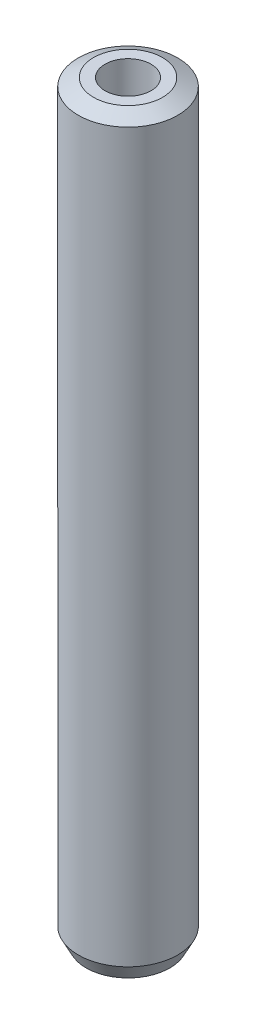
ISO-10303-21;
HEADER;
FILE_DESCRIPTION(('STEP AP214'),'2;1');
FILE_NAME('part.step','',(''),(''),'','','');
FILE_SCHEMA(('AUTOMOTIVE_DESIGN { 1 0 10303 214 1 1 1 1 }'));
ENDSEC;
DATA;
#1=APPLICATION_CONTEXT('core data for automotive mechanical design processes');
#2=APPLICATION_PROTOCOL_DEFINITION('international standard','automotive_design',2000,#1);
#3=PRODUCT_CONTEXT('',#1,'mechanical');
#4=PRODUCT('Part','Part','',(#3));
#5=PRODUCT_RELATED_PRODUCT_CATEGORY('part','',(#4));
#6=PRODUCT_DEFINITION_FORMATION('','',#4);
#7=PRODUCT_DEFINITION_CONTEXT('part definition',#1,'design');
#8=PRODUCT_DEFINITION('design','',#6,#7);
#9=PRODUCT_DEFINITION_SHAPE('','',#8);
#10=(LENGTH_UNIT() NAMED_UNIT(*) SI_UNIT(.MILLI.,.METRE.));
#11=(NAMED_UNIT(*) PLANE_ANGLE_UNIT() SI_UNIT($,.RADIAN.));
#12=(NAMED_UNIT(*) SI_UNIT($,.STERADIAN.) SOLID_ANGLE_UNIT());
#13=UNCERTAINTY_MEASURE_WITH_UNIT(LENGTH_MEASURE(1.E-05),#10,'distance_accuracy_value','');
#14=(GEOMETRIC_REPRESENTATION_CONTEXT(3) GLOBAL_UNCERTAINTY_ASSIGNED_CONTEXT((#13)) GLOBAL_UNIT_ASSIGNED_CONTEXT((#10,
#11,#12)) REPRESENTATION_CONTEXT('',''));
#15=CARTESIAN_POINT('',(0.,0.,0.));
#16=DIRECTION('',(0.,0.,1.));
#17=DIRECTION('',(1.,0.,0.));
#18=AXIS2_PLACEMENT_3D('',#15,#16,#17);
#19=CARTESIAN_POINT('',(0.,377.081839434753,0.));
#20=DIRECTION('',(0.,-1.,0.));
#21=DIRECTION('',(0.,0.,-1.));
#22=AXIS2_PLACEMENT_3D('',#19,#20,#21);
#23=CYLINDRICAL_SURFACE('',#22,25.);
#24=CARTESIAN_POINT('',(0.,373.112786849793,0.));
#25=DIRECTION('',(0.,1.,0.));
#26=DIRECTION('',(0.,0.,1.));
#27=AXIS2_PLACEMENT_3D('',#24,#25,#26);
#28=CIRCLE('',#27,25.);
#29=CARTESIAN_POINT('',(0.,373.112786849793,-25.));
#30=VERTEX_POINT('',#29);
#31=EDGE_CURVE('E50',#30,#30,#28,.F.);
#32=CARTESIAN_POINT('',(0.,7.66266430747042,0.));
#33=DIRECTION('',(0.,1.,0.));
#34=DIRECTION('',(0.,0.,1.));
#35=AXIS2_PLACEMENT_3D('',#32,#33,#34);
#36=CIRCLE('',#35,25.);
#37=CARTESIAN_POINT('',(0.,7.66266430747037,-25.));
#38=VERTEX_POINT('',#37);
#39=EDGE_CURVE('E51',#38,#38,#36,.T.);
#40=CARTESIAN_POINT('',(0.,373.112786849793,-25.));
#41=CARTESIAN_POINT('',(0.,369.306014739977,-25.));
#42=CARTESIAN_POINT('',(0.,365.499242630161,-25.));
#43=CARTESIAN_POINT('',(0.,357.88569841053,-25.));
#44=CARTESIAN_POINT('',(0.,354.078926300714,-25.));
#45=CARTESIAN_POINT('',(0.,346.465382081082,-25.));
#46=CARTESIAN_POINT('',(0.,342.658609971266,-25.));
#47=CARTESIAN_POINT('',(0.,335.045065751634,-25.));
#48=CARTESIAN_POINT('',(0.,331.238293641819,-25.));
#49=CARTESIAN_POINT('',(0.,323.624749422187,-25.));
#50=CARTESIAN_POINT('',(0.,319.817977312371,-25.));
#51=CARTESIAN_POINT('',(0.,312.204433092739,-25.));
#52=CARTESIAN_POINT('',(0.,308.397660982923,-25.));
#53=CARTESIAN_POINT('',(0.,300.784116763292,-25.));
#54=CARTESIAN_POINT('',(0.,296.977344653476,-25.));
#55=CARTESIAN_POINT('',(0.,289.363800433844,-25.));
#56=CARTESIAN_POINT('',(0.,285.557028324028,-25.));
#57=CARTESIAN_POINT('',(0.,277.943484104397,-25.));
#58=CARTESIAN_POINT('',(0.,274.136711994581,-25.));
#59=CARTESIAN_POINT('',(0.,266.523167774949,-25.));
#60=CARTESIAN_POINT('',(0.,262.716395665133,-25.));
#61=CARTESIAN_POINT('',(0.,255.102851445501,-25.));
#62=CARTESIAN_POINT('',(0.,251.296079335685,-25.));
#63=CARTESIAN_POINT('',(0.,243.682535116054,-25.));
#64=CARTESIAN_POINT('',(0.,239.875763006238,-25.));
#65=CARTESIAN_POINT('',(0.,232.262218786606,-25.));
#66=CARTESIAN_POINT('',(0.,228.45544667679,-25.));
#67=CARTESIAN_POINT('',(0.,220.841902457159,-25.));
#68=CARTESIAN_POINT('',(0.,217.035130347343,-25.));
#69=CARTESIAN_POINT('',(0.,209.421586127711,-25.));
#70=CARTESIAN_POINT('',(0.,205.614814017895,-25.));
#71=CARTESIAN_POINT('',(0.,198.001269798263,-25.));
#72=CARTESIAN_POINT('',(0.,194.194497688448,-25.));
#73=CARTESIAN_POINT('',(0.,186.580953468816,-25.));
#74=CARTESIAN_POINT('',(0.,182.774181359,-25.));
#75=CARTESIAN_POINT('',(0.,175.160637139368,-25.));
#76=CARTESIAN_POINT('',(0.,171.353865029552,-25.));
#77=CARTESIAN_POINT('',(0.,163.740320809921,-25.));
#78=CARTESIAN_POINT('',(0.,159.933548700105,-25.));
#79=CARTESIAN_POINT('',(0.,152.320004480473,-25.));
#80=CARTESIAN_POINT('',(0.,148.513232370657,-25.));
#81=CARTESIAN_POINT('',(0.,140.899688151026,-25.));
#82=CARTESIAN_POINT('',(0.,137.09291604121,-25.));
#83=CARTESIAN_POINT('',(0.,129.479371821578,-25.));
#84=CARTESIAN_POINT('',(0.,125.672599711762,-25.));
#85=CARTESIAN_POINT('',(0.,118.05905549213,-25.));
#86=CARTESIAN_POINT('',(0.,114.252283382315,-25.));
#87=CARTESIAN_POINT('',(0.,106.638739162683,-25.));
#88=CARTESIAN_POINT('',(0.,102.831967052867,-25.));
#89=CARTESIAN_POINT('',(0.,95.2184228332352,-25.));
#90=CARTESIAN_POINT('',(0.,91.4116507234193,-25.));
#91=CARTESIAN_POINT('',(0.,83.7981065037876,-25.));
#92=CARTESIAN_POINT('',(0.,79.9913343939718,-25.));
#93=CARTESIAN_POINT('',(0.,72.37779017434,-25.));
#94=CARTESIAN_POINT('',(0.,68.5710180645242,-25.));
#95=CARTESIAN_POINT('',(0.,60.9574738448925,-25.));
#96=CARTESIAN_POINT('',(0.,57.1507017350766,-25.));
#97=CARTESIAN_POINT('',(0.,49.5371575154449,-25.));
#98=CARTESIAN_POINT('',(0.,45.730385405629,-25.));
#99=CARTESIAN_POINT('',(0.,38.1168411859973,-25.));
#100=CARTESIAN_POINT('',(0.,34.3100690761814,-25.));
#101=CARTESIAN_POINT('',(0.,26.6965248565497,-25.));
#102=CARTESIAN_POINT('',(0.,22.8897527467339,-25.));
#103=CARTESIAN_POINT('',(0.,15.2762085271021,-25.));
#104=CARTESIAN_POINT('',(0.,11.4694364172862,-25.));
#105=CARTESIAN_POINT('',(0.,7.66266430747037,-25.));
#106=B_SPLINE_CURVE_WITH_KNOTS('',3,(#40,#41,#42,#43,#44,#45,#46,#47,#48,#49,#50,#51,#52,#53,
#54,#55,#56,#57,#58,#59,#60,#61,#62,#63,#64,#65,#66,#67,#68,#69,#70,#71,#72,#73,#74,#75,#76,#77,
#78,#79,#80,#81,#82,#83,#84,#85,#86,#87,#88,#89,#90,#91,#92,#93,#94,#95,#96,#97,#98,#99,#100,
#101,#102,#103,#104,#105),.UNSPECIFIED.,.F.,.F.,(4,2,2,2,2,2,2,2,2,2,2,2,2,2,2,2,2,2,2,2,2,2,2,
2,2,2,2,2,2,2,2,2,4),(0.,11.4203163294476,22.8406326588952,34.2609489883428,45.6812653177904,
57.1015816472379,68.5218979766855,79.9422143061331,91.3625306355807,102.782846965028,
114.203163294476,125.623479623923,137.043795953371,148.464112282819,159.884428612266,
171.304744941714,182.725061271161,194.145377600609,205.565693930057,216.986010259504,
228.406326588952,239.826642918399,251.246959247847,262.667275577294,274.087591906742,
285.50790823619,296.928224565637,308.348540895085,319.768857224532,331.18917355398,
342.609489883427,354.029806212875,365.450122542323),.UNSPECIFIED.);
#107=EDGE_CURVE('BSEAM39',#30,#38,#106,.T.);
#108=ORIENTED_EDGE('',*,*,#31,.T.);
#109=ORIENTED_EDGE('',*,*,#39,.T.);
#110=ORIENTED_EDGE('',*,*,#107,.T.);
#111=ORIENTED_EDGE('',*,*,#107,.F.);
#112=EDGE_LOOP('',(#108,#110,#109,#111));
#113=FACE_BOUND('',#112,.T.);
#114=ADVANCED_FACE('F39',(#113),#23,.T.);
#115=CARTESIAN_POINT('',(0.,377.081839434753,0.));
#116=DIRECTION('',(0.,1.,0.));
#117=DIRECTION('',(0.,0.,1.));
#118=AXIS2_PLACEMENT_3D('',#115,#116,#117);
#119=PLANE('',#118);
#120=CARTESIAN_POINT('',(0.,377.081839434753,0.));
#121=DIRECTION('',(0.,1.,0.));
#122=DIRECTION('',(0.,0.,1.));
#123=AXIS2_PLACEMENT_3D('',#120,#121,#122);
#124=CIRCLE('',#123,17.3373356925307);
#125=CARTESIAN_POINT('',(0.,377.081839434753,17.3373356925307));
#126=VERTEX_POINT('',#125);
#127=EDGE_CURVE('E54',#126,#126,#124,.T.);
#128=ORIENTED_EDGE('',*,*,#127,.T.);
#129=EDGE_LOOP('',(#128));
#130=FACE_BOUND('',#129,.T.);
#131=CARTESIAN_POINT('',(0.,377.081839434753,0.));
#132=DIRECTION('',(0.,1.,0.));
#133=DIRECTION('',(0.,0.,1.));
#134=AXIS2_PLACEMENT_3D('',#131,#132,#133);
#135=CIRCLE('',#134,11.5721450299098);
#136=CARTESIAN_POINT('',(0.,377.081839434753,-11.5721450299098));
#137=VERTEX_POINT('',#136);
#138=EDGE_CURVE('E58',#137,#137,#135,.T.);
#139=ORIENTED_EDGE('',*,*,#138,.F.);
#140=EDGE_LOOP('',(#139));
#141=FACE_BOUND('',#140,.T.);
#142=ADVANCED_FACE('F69',(#130,#141),#119,.T.);
#143=CARTESIAN_POINT('',(0.,0.,0.));
#144=DIRECTION('',(0.,1.,0.));
#145=DIRECTION('',(0.,0.,1.));
#146=AXIS2_PLACEMENT_3D('',#143,#144,#145);
#147=PLANE('',#146);
#148=CARTESIAN_POINT('',(0.,0.,0.));
#149=DIRECTION('',(0.,1.,0.));
#150=DIRECTION('',(0.,0.,1.));
#151=AXIS2_PLACEMENT_3D('',#148,#149,#150);
#152=CIRCLE('',#151,21.0309474150397);
#153=CARTESIAN_POINT('',(0.,0.,21.0309474150397));
#154=VERTEX_POINT('',#153);
#155=EDGE_CURVE('E10',#154,#154,#152,.F.);
#156=ORIENTED_EDGE('',*,*,#155,.T.);
#157=EDGE_LOOP('',(#156));
#158=FACE_BOUND('',#157,.T.);
#159=CARTESIAN_POINT('',(0.,0.,0.));
#160=DIRECTION('',(0.,1.,0.));
#161=DIRECTION('',(0.,0.,1.));
#162=AXIS2_PLACEMENT_3D('',#159,#160,#161);
#163=CIRCLE('',#162,11.5721450299098);
#164=CARTESIAN_POINT('',(0.,0.,-11.5721450299098));
#165=VERTEX_POINT('',#164);
#166=EDGE_CURVE('E63',#165,#165,#163,.T.);
#167=ORIENTED_EDGE('',*,*,#166,.T.);
#168=EDGE_LOOP('',(#167));
#169=FACE_BOUND('',#168,.T.);
#170=ADVANCED_FACE('F75',(#158,#169),#147,.F.);
#171=CARTESIAN_POINT('',(0.,377.081839434753,0.));
#172=DIRECTION('',(0.,-1.,0.));
#173=DIRECTION('',(0.,0.,-1.));
#174=AXIS2_PLACEMENT_3D('',#171,#172,#173);
#175=CYLINDRICAL_SURFACE('',#174,11.5721450299098);
#176=CARTESIAN_POINT('',(0.,377.081839434753,-11.5721450299098));
#177=CARTESIAN_POINT('',(0.,373.153903607307,-11.5721450299098));
#178=CARTESIAN_POINT('',(0.,369.225967779862,-11.5721450299098));
#179=CARTESIAN_POINT('',(0.,361.370096124971,-11.5721450299098));
#180=CARTESIAN_POINT('',(0.,357.442160297526,-11.5721450299098));
#181=CARTESIAN_POINT('',(0.,349.586288642635,-11.5721450299098));
#182=CARTESIAN_POINT('',(0.,345.65835281519,-11.5721450299098));
#183=CARTESIAN_POINT('',(0.,337.802481160299,-11.5721450299098));
#184=CARTESIAN_POINT('',(0.,333.874545332854,-11.5721450299098));
#185=CARTESIAN_POINT('',(0.,326.018673677963,-11.5721450299098));
#186=CARTESIAN_POINT('',(0.,322.090737850518,-11.5721450299098));
#187=CARTESIAN_POINT('',(0.,314.234866195627,-11.5721450299098));
#188=CARTESIAN_POINT('',(0.,310.306930368182,-11.5721450299098));
#189=CARTESIAN_POINT('',(0.,302.451058713291,-11.5721450299098));
#190=CARTESIAN_POINT('',(0.,298.523122885846,-11.5721450299098));
#191=CARTESIAN_POINT('',(0.,290.667251230955,-11.5721450299098));
#192=CARTESIAN_POINT('',(0.,286.73931540351,-11.5721450299098));
#193=CARTESIAN_POINT('',(0.,278.883443748619,-11.5721450299098));
#194=CARTESIAN_POINT('',(0.,274.955507921174,-11.5721450299098));
#195=CARTESIAN_POINT('',(0.,267.099636266283,-11.5721450299098));
#196=CARTESIAN_POINT('',(0.,263.171700438838,-11.5721450299098));
#197=CARTESIAN_POINT('',(0.,255.315828783947,-11.5721450299098));
#198=CARTESIAN_POINT('',(0.,251.387892956502,-11.5721450299098));
#199=CARTESIAN_POINT('',(0.,243.532021301611,-11.5721450299098));
#200=CARTESIAN_POINT('',(0.,239.604085474166,-11.5721450299098));
#201=CARTESIAN_POINT('',(0.,231.748213819275,-11.5721450299098));
#202=CARTESIAN_POINT('',(0.,227.82027799183,-11.5721450299098));
#203=CARTESIAN_POINT('',(0.,219.964406336939,-11.5721450299098));
#204=CARTESIAN_POINT('',(0.,216.036470509494,-11.5721450299098));
#205=CARTESIAN_POINT('',(0.,208.180598854603,-11.5721450299098));
#206=CARTESIAN_POINT('',(0.,204.252663027158,-11.5721450299098));
#207=CARTESIAN_POINT('',(0.,196.396791372267,-11.5721450299098));
#208=CARTESIAN_POINT('',(0.,192.468855544822,-11.5721450299098));
#209=CARTESIAN_POINT('',(0.,184.612983889931,-11.5721450299098));
#210=CARTESIAN_POINT('',(0.,180.685048062486,-11.5721450299098));
#211=CARTESIAN_POINT('',(0.,172.829176407595,-11.5721450299098));
#212=CARTESIAN_POINT('',(0.,168.90124058015,-11.5721450299098));
#213=CARTESIAN_POINT('',(0.,161.045368925259,-11.5721450299098));
#214=CARTESIAN_POINT('',(0.,157.117433097814,-11.5721450299098));
#215=CARTESIAN_POINT('',(0.,149.261561442923,-11.5721450299098));
#216=CARTESIAN_POINT('',(0.,145.333625615478,-11.5721450299098));
#217=CARTESIAN_POINT('',(0.,137.477753960587,-11.5721450299098));
#218=CARTESIAN_POINT('',(0.,133.549818133142,-11.5721450299098));
#219=CARTESIAN_POINT('',(0.,125.693946478251,-11.5721450299098));
#220=CARTESIAN_POINT('',(0.,121.766010650806,-11.5721450299098));
#221=CARTESIAN_POINT('',(0.,113.910138995915,-11.5721450299098));
#222=CARTESIAN_POINT('',(0.,109.98220316847,-11.5721450299098));
#223=CARTESIAN_POINT('',(0.,102.126331513579,-11.5721450299098));
#224=CARTESIAN_POINT('',(0.,98.1983956861335,-11.5721450299098));
#225=CARTESIAN_POINT('',(0.,90.3425240312428,-11.5721450299098));
#226=CARTESIAN_POINT('',(0.,86.4145882037975,-11.5721450299098));
#227=CARTESIAN_POINT('',(0.,78.5587165489068,-11.5721450299098));
#228=CARTESIAN_POINT('',(0.,74.6307807214615,-11.5721450299098));
#229=CARTESIAN_POINT('',(0.,66.7749090665708,-11.5721450299098));
#230=CARTESIAN_POINT('',(0.,62.8469732391254,-11.5721450299098));
#231=CARTESIAN_POINT('',(0.,54.9911015842347,-11.5721450299098));
#232=CARTESIAN_POINT('',(0.,51.0631657567894,-11.5721450299098));
#233=CARTESIAN_POINT('',(0.,43.2072941018987,-11.5721450299098));
#234=CARTESIAN_POINT('',(0.,39.2793582744534,-11.5721450299098));
#235=CARTESIAN_POINT('',(0.,31.4234866195627,-11.5721450299098));
#236=CARTESIAN_POINT('',(0.,27.4955507921174,-11.5721450299098));
#237=CARTESIAN_POINT('',(0.,19.6396791372267,-11.5721450299098));
#238=CARTESIAN_POINT('',(0.,15.7117433097813,-11.5721450299098));
#239=CARTESIAN_POINT('',(0.,7.85587165489064,-11.5721450299098));
#240=CARTESIAN_POINT('',(0.,3.92793582744529,-11.5721450299098));
#241=CARTESIAN_POINT('',(0.,0.,-11.5721450299098));
#242=B_SPLINE_CURVE_WITH_KNOTS('',3,(#176,#177,#178,#179,#180,#181,#182,#183,#184,#185,#186,
#187,#188,#189,#190,#191,#192,#193,#194,#195,#196,#197,#198,#199,#200,#201,#202,#203,#204,#205,
#206,#207,#208,#209,#210,#211,#212,#213,#214,#215,#216,#217,#218,#219,#220,#221,#222,#223,#224,
#225,#226,#227,#228,#229,#230,#231,#232,#233,#234,#235,#236,#237,#238,#239,#240,#241),
.UNSPECIFIED.,.F.,.F.,(4,2,2,2,2,2,2,2,2,2,2,2,2,2,2,2,2,2,2,2,2,2,2,2,2,2,2,2,2,2,2,2,4),(0.,
11.783807482336,23.5676149646721,35.3514224470081,47.1352299293442,58.9190374116801,
70.7028448940162,82.4866523763522,94.2704598586883,106.054267341024,117.83807482336,
129.621882305696,141.405689788032,153.189497270368,164.973304752704,176.75711223504,
188.540919717376,200.324727199712,212.108534682049,223.892342164385,235.676149646721,
247.459957129057,259.243764611393,271.027572093729,282.811379576065,294.595187058401,
306.378994540737,318.162802023073,329.946609505409,341.730416987745,353.514224470081,
365.298031952417,377.081839434753),.UNSPECIFIED.);
#243=EDGE_CURVE('BSEAM70',#137,#165,#242,.T.);
#244=ORIENTED_EDGE('',*,*,#138,.T.);
#245=ORIENTED_EDGE('',*,*,#166,.F.);
#246=ORIENTED_EDGE('',*,*,#243,.T.);
#247=ORIENTED_EDGE('',*,*,#243,.F.);
#248=EDGE_LOOP('',(#244,#246,#245,#247));
#249=FACE_BOUND('',#248,.T.);
#250=ADVANCED_FACE('F70',(#249),#175,.F.);
#251=CARTESIAN_POINT('',(0.,377.081839434753,0.));
#252=DIRECTION('',(0.,-1.,0.));
#253=DIRECTION('',(0.,0.,-1.));
#254=AXIS2_PLACEMENT_3D('',#251,#252,#253);
#255=CONICAL_SURFACE('',#254,17.3373356925307,1.09287398409506);
#256=ORIENTED_EDGE('',*,*,#31,.F.);
#257=EDGE_LOOP('',(#256));
#258=FACE_BOUND('',#257,.T.);
#259=ORIENTED_EDGE('',*,*,#127,.F.);
#260=EDGE_LOOP('',(#259));
#261=FACE_BOUND('',#260,.T.);
#262=ADVANCED_FACE('F81',(#258,#261),#255,.T.);
#263=CARTESIAN_POINT('',(0.,7.66266430747042,0.));
#264=DIRECTION('',(0.,1.,0.));
#265=DIRECTION('',(0.,0.,1.));
#266=AXIS2_PLACEMENT_3D('',#263,#264,#265);
#267=CONICAL_SURFACE('',#266,25.,0.477922342699837);
#268=ORIENTED_EDGE('',*,*,#155,.F.);
#269=EDGE_LOOP('',(#268));
#270=FACE_BOUND('',#269,.T.);
#271=ORIENTED_EDGE('',*,*,#39,.F.);
#272=EDGE_LOOP('',(#271));
#273=FACE_BOUND('',#272,.T.);
#274=ADVANCED_FACE('F45',(#270,#273),#267,.T.);
#275=CLOSED_SHELL('',(#114,#142,#170,#250,#262,#274));
#276=MANIFOLD_SOLID_BREP('B2',#275);
#277=ADVANCED_BREP_SHAPE_REPRESENTATION('',(#18,#276),#14);
#278=SHAPE_DEFINITION_REPRESENTATION(#9,#277);
ENDSEC;
END-ISO-10303-21;
